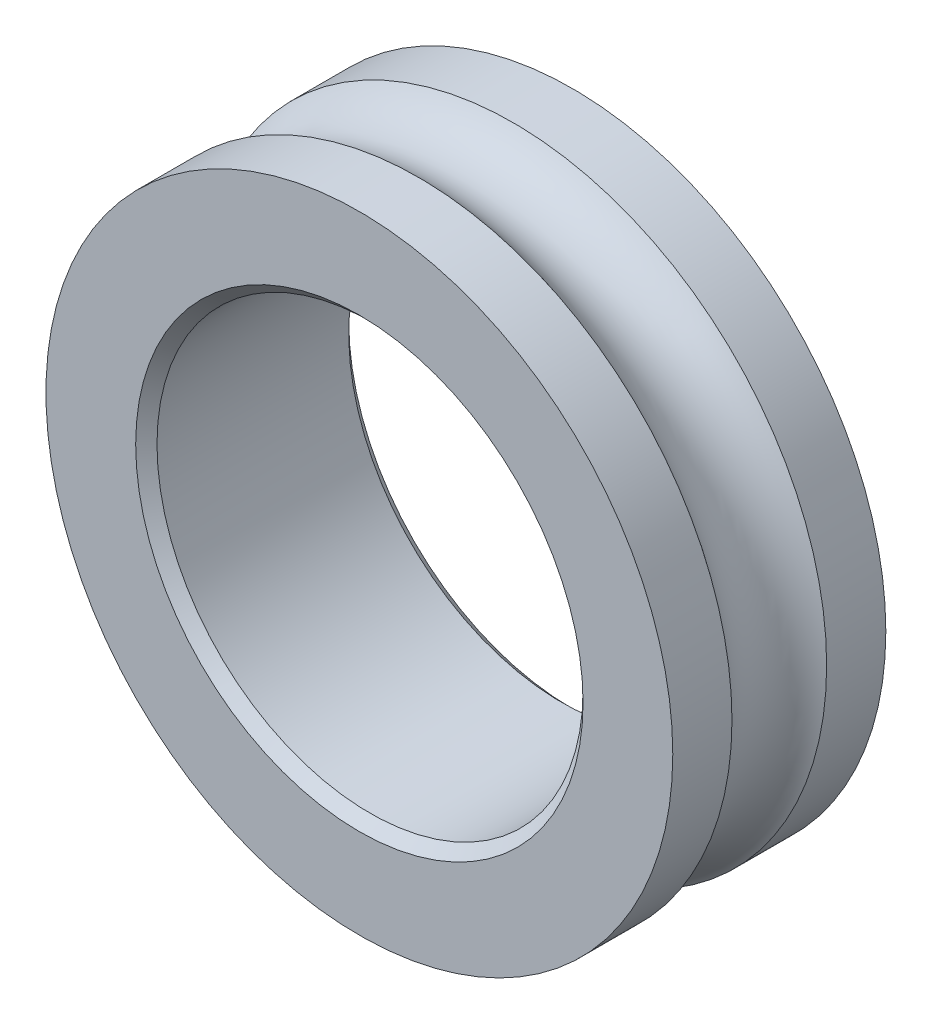
ISO-10303-21;
HEADER;
FILE_DESCRIPTION(('STEP AP214'),'2;1');
FILE_NAME('part.step','',(''),(''),'','','');
FILE_SCHEMA(('AUTOMOTIVE_DESIGN { 1 0 10303 214 1 1 1 1 }'));
ENDSEC;
DATA;
#1=APPLICATION_CONTEXT('core data for automotive mechanical design processes');
#2=APPLICATION_PROTOCOL_DEFINITION('international standard','automotive_design',2000,#1);
#3=PRODUCT_CONTEXT('',#1,'mechanical');
#4=PRODUCT('Part','Part','',(#3));
#5=PRODUCT_RELATED_PRODUCT_CATEGORY('part','',(#4));
#6=PRODUCT_DEFINITION_FORMATION('','',#4);
#7=PRODUCT_DEFINITION_CONTEXT('part definition',#1,'design');
#8=PRODUCT_DEFINITION('design','',#6,#7);
#9=PRODUCT_DEFINITION_SHAPE('','',#8);
#10=(LENGTH_UNIT() NAMED_UNIT(*) SI_UNIT(.MILLI.,.METRE.));
#11=(NAMED_UNIT(*) PLANE_ANGLE_UNIT() SI_UNIT($,.RADIAN.));
#12=(NAMED_UNIT(*) SI_UNIT($,.STERADIAN.) SOLID_ANGLE_UNIT());
#13=UNCERTAINTY_MEASURE_WITH_UNIT(LENGTH_MEASURE(1.E-05),#10,'distance_accuracy_value','');
#14=(GEOMETRIC_REPRESENTATION_CONTEXT(3) GLOBAL_UNCERTAINTY_ASSIGNED_CONTEXT((#13)) GLOBAL_UNIT_ASSIGNED_CONTEXT((#10,
#11,#12)) REPRESENTATION_CONTEXT('',''));
#15=CARTESIAN_POINT('',(0.,0.,0.));
#16=DIRECTION('',(0.,0.,1.));
#17=DIRECTION('',(1.,0.,0.));
#18=AXIS2_PLACEMENT_3D('',#15,#16,#17);
#19=CARTESIAN_POINT('',(0.,0.,0.));
#20=DIRECTION('',(0.,0.,1.));
#21=DIRECTION('',(1.,0.,0.));
#22=AXIS2_PLACEMENT_3D('',#19,#20,#21);
#23=TOROIDAL_SURFACE('',#22,10.31875,1.71627890103155);
#24=CARTESIAN_POINT('',(0.,0.,-1.41111111111112));
#25=DIRECTION('',(0.,0.,1.));
#26=DIRECTION('',(1.,0.,0.));
#27=AXIS2_PLACEMENT_3D('',#24,#25,#26);
#28=CIRCLE('',#27,9.34182692307694);
#29=CARTESIAN_POINT('',(9.34182692307694,0.,-1.41111111111112));
#30=VERTEX_POINT('',#29);
#31=EDGE_CURVE('E35',#30,#30,#28,.F.);
#32=ORIENTED_EDGE('',*,*,#31,.F.);
#33=EDGE_LOOP('',(#32));
#34=FACE_BOUND('',#33,.T.);
#35=CARTESIAN_POINT('',(0.,0.,1.4111111111111));
#36=DIRECTION('',(0.,0.,1.));
#37=DIRECTION('',(1.,0.,0.));
#38=AXIS2_PLACEMENT_3D('',#35,#36,#37);
#39=CIRCLE('',#38,9.34182692307694);
#40=CARTESIAN_POINT('',(9.34182692307694,0.,1.4111111111111));
#41=VERTEX_POINT('',#40);
#42=EDGE_CURVE('E38',#41,#41,#39,.T.);
#43=ORIENTED_EDGE('',*,*,#42,.F.);
#44=EDGE_LOOP('',(#43));
#45=FACE_BOUND('',#44,.T.);
#46=ADVANCED_FACE('F15',(#34,#45),#23,.F.);
#47=CARTESIAN_POINT('',(0.,0.,3.175));
#48=DIRECTION('',(0.,0.,1.));
#49=DIRECTION('',(1.,0.,0.));
#50=AXIS2_PLACEMENT_3D('',#47,#48,#49);
#51=CYLINDRICAL_SURFACE('',#50,9.34182692307694);
#52=CARTESIAN_POINT('',(0.,0.,3.175));
#53=DIRECTION('',(0.,0.,1.));
#54=DIRECTION('',(1.,0.,0.));
#55=AXIS2_PLACEMENT_3D('',#52,#53,#54);
#56=CIRCLE('',#55,9.34182692307694);
#57=CARTESIAN_POINT('',(9.34182692307694,0.,3.175));
#58=VERTEX_POINT('',#57);
#59=EDGE_CURVE('E19',#58,#58,#56,.F.);
#60=ORIENTED_EDGE('',*,*,#59,.T.);
#61=EDGE_LOOP('',(#60));
#62=FACE_BOUND('',#61,.T.);
#63=ORIENTED_EDGE('',*,*,#42,.T.);
#64=EDGE_LOOP('',(#63));
#65=FACE_BOUND('',#64,.T.);
#66=ADVANCED_FACE('F57',(#62,#65),#51,.T.);
#67=CARTESIAN_POINT('',(0.,0.,3.175));
#68=DIRECTION('',(0.,0.,1.));
#69=DIRECTION('',(1.,0.,0.));
#70=AXIS2_PLACEMENT_3D('',#67,#68,#69);
#71=CYLINDRICAL_SURFACE('',#70,9.34182692307694);
#72=CARTESIAN_POINT('',(0.,0.,-3.175));
#73=DIRECTION('',(0.,0.,1.));
#74=DIRECTION('',(1.,0.,0.));
#75=AXIS2_PLACEMENT_3D('',#72,#73,#74);
#76=CIRCLE('',#75,9.34182692307694);
#77=CARTESIAN_POINT('',(9.34182692307694,0.,-3.175));
#78=VERTEX_POINT('',#77);
#79=EDGE_CURVE('E50',#78,#78,#76,.T.);
#80=ORIENTED_EDGE('',*,*,#79,.T.);
#81=EDGE_LOOP('',(#80));
#82=FACE_BOUND('',#81,.T.);
#83=ORIENTED_EDGE('',*,*,#31,.T.);
#84=EDGE_LOOP('',(#83));
#85=FACE_BOUND('',#84,.T.);
#86=ADVANCED_FACE('F63',(#82,#85),#71,.T.);
#87=CARTESIAN_POINT('',(0.,9.34182692307694,3.175));
#88=DIRECTION('',(0.,0.,-1.));
#89=DIRECTION('',(-1.,0.,0.));
#90=AXIS2_PLACEMENT_3D('',#87,#88,#89);
#91=PLANE('',#90);
#92=CARTESIAN_POINT('',(0.,0.,3.17499998318855));
#93=DIRECTION('',(0.,0.,1.));
#94=DIRECTION('',(1.,0.,0.));
#95=AXIS2_PLACEMENT_3D('',#92,#93,#94);
#96=CIRCLE('',#95,6.66750001681144);
#97=CARTESIAN_POINT('',(6.66750001681144,0.,3.17499998318855));
#98=VERTEX_POINT('',#97);
#99=EDGE_CURVE('E48',#98,#98,#96,.F.);
#100=ORIENTED_EDGE('',*,*,#99,.T.);
#101=EDGE_LOOP('',(#100));
#102=FACE_BOUND('',#101,.T.);
#103=ORIENTED_EDGE('',*,*,#59,.F.);
#104=EDGE_LOOP('',(#103));
#105=FACE_BOUND('',#104,.T.);
#106=ADVANCED_FACE('F60',(#102,#105),#91,.F.);
#107=CARTESIAN_POINT('',(0.,6.6675,-3.175));
#108=DIRECTION('',(0.,0.,1.));
#109=DIRECTION('',(1.,0.,0.));
#110=AXIS2_PLACEMENT_3D('',#107,#108,#109);
#111=PLANE('',#110);
#112=CARTESIAN_POINT('',(0.,0.,-3.17499998318855));
#113=DIRECTION('',(0.,0.,-1.));
#114=DIRECTION('',(0.,1.,0.));
#115=AXIS2_PLACEMENT_3D('',#112,#113,#114);
#116=CIRCLE('',#115,6.66750001681145);
#117=CARTESIAN_POINT('',(0.,6.66750001681145,-3.17499998318855));
#118=VERTEX_POINT('',#117);
#119=EDGE_CURVE('E28',#118,#118,#116,.F.);
#120=ORIENTED_EDGE('',*,*,#119,.T.);
#121=EDGE_LOOP('',(#120));
#122=FACE_BOUND('',#121,.T.);
#123=ORIENTED_EDGE('',*,*,#79,.F.);
#124=EDGE_LOOP('',(#123));
#125=FACE_BOUND('',#124,.T.);
#126=ADVANCED_FACE('F62',(#122,#125),#111,.F.);
#127=CARTESIAN_POINT('',(0.,0.,3.17499998318855));
#128=DIRECTION('',(0.,0.,1.));
#129=DIRECTION('',(1.,0.,0.));
#130=AXIS2_PLACEMENT_3D('',#127,#128,#129);
#131=CONICAL_SURFACE('',#130,6.66750001681144,0.785398162499993);
#132=CARTESIAN_POINT('',(0.,0.,2.8575));
#133=DIRECTION('',(0.,0.,1.));
#134=DIRECTION('',(1.,0.,0.));
#135=AXIS2_PLACEMENT_3D('',#132,#133,#134);
#136=CIRCLE('',#135,6.35);
#137=CARTESIAN_POINT('',(6.35,0.,2.8575));
#138=VERTEX_POINT('',#137);
#139=EDGE_CURVE('E23',#138,#138,#136,.F.);
#140=ORIENTED_EDGE('',*,*,#139,.T.);
#141=EDGE_LOOP('',(#140));
#142=FACE_BOUND('',#141,.T.);
#143=ORIENTED_EDGE('',*,*,#99,.F.);
#144=EDGE_LOOP('',(#143));
#145=FACE_BOUND('',#144,.T.);
#146=ADVANCED_FACE('F71',(#142,#145),#131,.F.);
#147=CARTESIAN_POINT('',(0.,0.,-3.17499998318855));
#148=DIRECTION('',(0.,0.,-1.));
#149=DIRECTION('',(0.,1.,0.));
#150=AXIS2_PLACEMENT_3D('',#147,#148,#149);
#151=CONICAL_SURFACE('',#150,6.66750001681145,0.785398162500003);
#152=CARTESIAN_POINT('',(0.,0.,-2.8575));
#153=DIRECTION('',(0.,0.,1.));
#154=DIRECTION('',(1.,0.,0.));
#155=AXIS2_PLACEMENT_3D('',#152,#153,#154);
#156=CIRCLE('',#155,6.35);
#157=CARTESIAN_POINT('',(6.35,0.,-2.8575));
#158=VERTEX_POINT('',#157);
#159=EDGE_CURVE('E10',#158,#158,#156,.T.);
#160=ORIENTED_EDGE('',*,*,#159,.T.);
#161=EDGE_LOOP('',(#160));
#162=FACE_BOUND('',#161,.T.);
#163=ORIENTED_EDGE('',*,*,#119,.F.);
#164=EDGE_LOOP('',(#163));
#165=FACE_BOUND('',#164,.T.);
#166=ADVANCED_FACE('F77',(#162,#165),#151,.F.);
#167=CARTESIAN_POINT('',(0.,0.,3.175));
#168=DIRECTION('',(0.,0.,1.));
#169=DIRECTION('',(1.,0.,0.));
#170=AXIS2_PLACEMENT_3D('',#167,#168,#169);
#171=CYLINDRICAL_SURFACE('',#170,6.35);
#172=ORIENTED_EDGE('',*,*,#159,.F.);
#173=EDGE_LOOP('',(#172));
#174=FACE_BOUND('',#173,.T.);
#175=ORIENTED_EDGE('',*,*,#139,.F.);
#176=EDGE_LOOP('',(#175));
#177=FACE_BOUND('',#176,.T.);
#178=ADVANCED_FACE('F75',(#174,#177),#171,.F.);
#179=CLOSED_SHELL('',(#46,#66,#86,#106,#126,#146,#166,#178));
#180=MANIFOLD_SOLID_BREP('B1',#179);
#181=ADVANCED_BREP_SHAPE_REPRESENTATION('',(#18,#180),#14);
#182=SHAPE_DEFINITION_REPRESENTATION(#9,#181);
ENDSEC;
END-ISO-10303-21;
